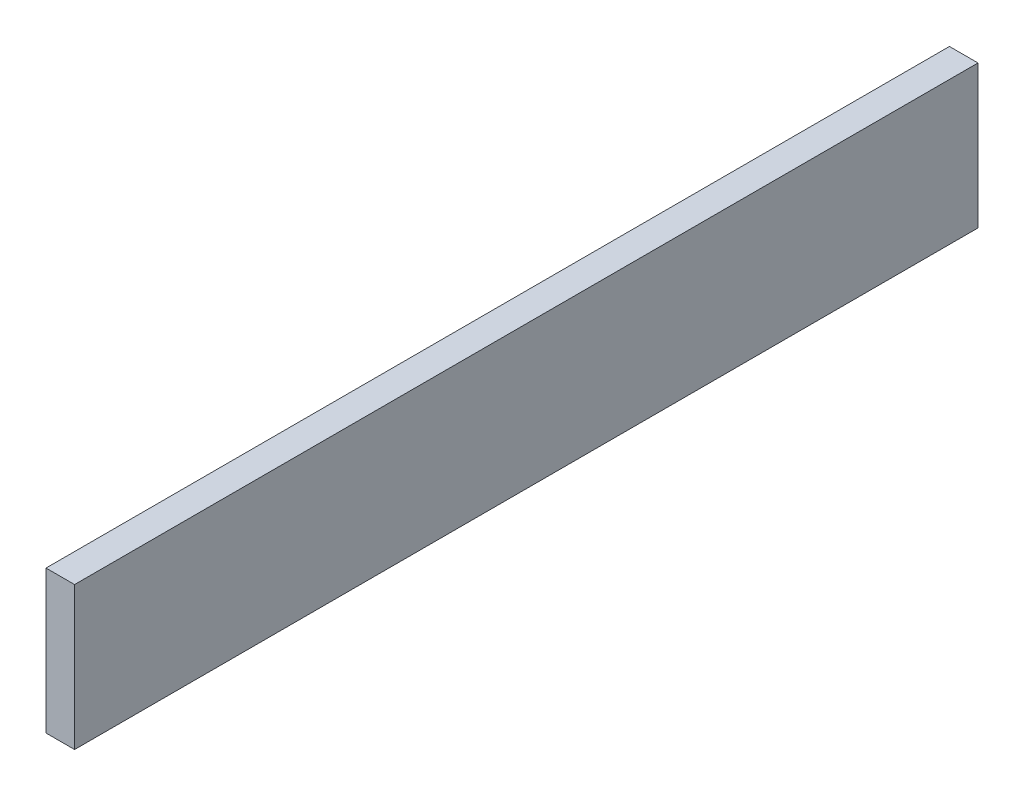
ISO-10303-21;
HEADER;
FILE_DESCRIPTION(('STEP AP214'),'2;1');
FILE_NAME('part.step','',(''),(''),'','','');
FILE_SCHEMA(('AUTOMOTIVE_DESIGN { 1 0 10303 214 1 1 1 1 }'));
ENDSEC;
DATA;
#1=APPLICATION_CONTEXT('core data for automotive mechanical design processes');
#2=APPLICATION_PROTOCOL_DEFINITION('international standard','automotive_design',2000,#1);
#3=PRODUCT_CONTEXT('',#1,'mechanical');
#4=PRODUCT('Part','Part','',(#3));
#5=PRODUCT_RELATED_PRODUCT_CATEGORY('part','',(#4));
#6=PRODUCT_DEFINITION_FORMATION('','',#4);
#7=PRODUCT_DEFINITION_CONTEXT('part definition',#1,'design');
#8=PRODUCT_DEFINITION('design','',#6,#7);
#9=PRODUCT_DEFINITION_SHAPE('','',#8);
#10=(LENGTH_UNIT() NAMED_UNIT(*) SI_UNIT(.MILLI.,.METRE.));
#11=(NAMED_UNIT(*) PLANE_ANGLE_UNIT() SI_UNIT($,.RADIAN.));
#12=(NAMED_UNIT(*) SI_UNIT($,.STERADIAN.) SOLID_ANGLE_UNIT());
#13=UNCERTAINTY_MEASURE_WITH_UNIT(LENGTH_MEASURE(1.E-05),#10,'distance_accuracy_value','');
#14=(GEOMETRIC_REPRESENTATION_CONTEXT(3) GLOBAL_UNCERTAINTY_ASSIGNED_CONTEXT((#13)) GLOBAL_UNIT_ASSIGNED_CONTEXT((#10,
#11,#12)) REPRESENTATION_CONTEXT('',''));
#15=CARTESIAN_POINT('',(0.,0.,0.));
#16=DIRECTION('',(0.,0.,1.));
#17=DIRECTION('',(1.,0.,0.));
#18=AXIS2_PLACEMENT_3D('',#15,#16,#17);
#19=CARTESIAN_POINT('',(1.,0.,0.));
#20=DIRECTION('',(0.,0.,-1.));
#21=DIRECTION('',(-1.,0.,0.));
#22=AXIS2_PLACEMENT_3D('',#19,#20,#21);
#23=PLANE('',#22);
#24=DIRECTION('',(0.,-1.,0.));
#25=VECTOR('',#24,1.);
#26=CARTESIAN_POINT('',(0.,0.,0.));
#27=LINE('',#26,#25);
#28=CARTESIAN_POINT('',(0.,5.,0.));
#29=VERTEX_POINT('',#28);
#30=CARTESIAN_POINT('',(0.,0.,0.));
#31=VERTEX_POINT('',#30);
#32=EDGE_CURVE('E98',#29,#31,#27,.T.);
#33=ORIENTED_EDGE('',*,*,#32,.T.);
#34=DIRECTION('',(-1.,0.,0.));
#35=VECTOR('',#34,1.);
#36=CARTESIAN_POINT('',(1.,0.,0.));
#37=LINE('',#36,#35);
#38=CARTESIAN_POINT('',(1.,0.,0.));
#39=VERTEX_POINT('',#38);
#40=EDGE_CURVE('E11',#39,#31,#37,.T.);
#41=ORIENTED_EDGE('',*,*,#40,.F.);
#42=DIRECTION('',(0.,-1.,0.));
#43=VECTOR('',#42,1.);
#44=CARTESIAN_POINT('',(1.,0.,0.));
#45=LINE('',#44,#43);
#46=CARTESIAN_POINT('',(1.,5.,0.));
#47=VERTEX_POINT('',#46);
#48=EDGE_CURVE('E86',#47,#39,#45,.T.);
#49=ORIENTED_EDGE('',*,*,#48,.F.);
#50=DIRECTION('',(-1.,0.,0.));
#51=VECTOR('',#50,1.);
#52=CARTESIAN_POINT('',(1.,5.,0.));
#53=LINE('',#52,#51);
#54=EDGE_CURVE('E94',#47,#29,#53,.T.);
#55=ORIENTED_EDGE('',*,*,#54,.T.);
#56=EDGE_LOOP('',(#33,#41,#49,#55));
#57=FACE_BOUND('',#56,.T.);
#58=ADVANCED_FACE('F35',(#57),#23,.F.);
#59=CARTESIAN_POINT('',(1.,0.,0.));
#60=DIRECTION('',(0.,1.,0.));
#61=DIRECTION('',(0.,0.,1.));
#62=AXIS2_PLACEMENT_3D('',#59,#60,#61);
#63=PLANE('',#62);
#64=DIRECTION('',(0.,0.,-1.));
#65=VECTOR('',#64,1.);
#66=CARTESIAN_POINT('',(0.,0.,0.));
#67=LINE('',#66,#65);
#68=CARTESIAN_POINT('',(0.,0.,-31.61));
#69=VERTEX_POINT('',#68);
#70=EDGE_CURVE('E90',#31,#69,#67,.T.);
#71=ORIENTED_EDGE('',*,*,#70,.T.);
#72=DIRECTION('',(-1.,0.,0.));
#73=VECTOR('',#72,1.);
#74=CARTESIAN_POINT('',(1.,0.,-31.61));
#75=LINE('',#74,#73);
#76=CARTESIAN_POINT('',(1.,0.,-31.61));
#77=VERTEX_POINT('',#76);
#78=EDGE_CURVE('E43',#77,#69,#75,.T.);
#79=ORIENTED_EDGE('',*,*,#78,.F.);
#80=DIRECTION('',(0.,0.,-1.));
#81=VECTOR('',#80,1.);
#82=CARTESIAN_POINT('',(1.,0.,0.));
#83=LINE('',#82,#81);
#84=EDGE_CURVE('E81',#39,#77,#83,.T.);
#85=ORIENTED_EDGE('',*,*,#84,.F.);
#86=ORIENTED_EDGE('',*,*,#40,.T.);
#87=EDGE_LOOP('',(#71,#79,#85,#86));
#88=FACE_BOUND('',#87,.T.);
#89=ADVANCED_FACE('F89',(#88),#63,.F.);
#90=CARTESIAN_POINT('',(1.,0.,-31.61));
#91=DIRECTION('',(0.,0.,1.));
#92=DIRECTION('',(1.,0.,0.));
#93=AXIS2_PLACEMENT_3D('',#90,#91,#92);
#94=PLANE('',#93);
#95=DIRECTION('',(0.,1.,0.));
#96=VECTOR('',#95,1.);
#97=CARTESIAN_POINT('',(0.,0.,-31.61));
#98=LINE('',#97,#96);
#99=CARTESIAN_POINT('',(0.,5.,-31.61));
#100=VERTEX_POINT('',#99);
#101=EDGE_CURVE('E68',#69,#100,#98,.T.);
#102=ORIENTED_EDGE('',*,*,#101,.T.);
#103=DIRECTION('',(-1.,0.,0.));
#104=VECTOR('',#103,1.);
#105=CARTESIAN_POINT('',(1.,5.,-31.61));
#106=LINE('',#105,#104);
#107=CARTESIAN_POINT('',(1.,5.,-31.61));
#108=VERTEX_POINT('',#107);
#109=EDGE_CURVE('E91',#108,#100,#106,.T.);
#110=ORIENTED_EDGE('',*,*,#109,.F.);
#111=DIRECTION('',(0.,1.,0.));
#112=VECTOR('',#111,1.);
#113=CARTESIAN_POINT('',(1.,0.,-31.61));
#114=LINE('',#113,#112);
#115=EDGE_CURVE('E84',#77,#108,#114,.T.);
#116=ORIENTED_EDGE('',*,*,#115,.F.);
#117=ORIENTED_EDGE('',*,*,#78,.T.);
#118=EDGE_LOOP('',(#102,#110,#116,#117));
#119=FACE_BOUND('',#118,.T.);
#120=ADVANCED_FACE('F92',(#119),#94,.F.);
#121=CARTESIAN_POINT('',(1.,5.,0.));
#122=DIRECTION('',(0.,-1.,0.));
#123=DIRECTION('',(0.,0.,-1.));
#124=AXIS2_PLACEMENT_3D('',#121,#122,#123);
#125=PLANE('',#124);
#126=DIRECTION('',(0.,0.,1.));
#127=VECTOR('',#126,1.);
#128=CARTESIAN_POINT('',(0.,5.,0.));
#129=LINE('',#128,#127);
#130=EDGE_CURVE('E74',#100,#29,#129,.T.);
#131=ORIENTED_EDGE('',*,*,#130,.T.);
#132=ORIENTED_EDGE('',*,*,#54,.F.);
#133=DIRECTION('',(0.,0.,1.));
#134=VECTOR('',#133,1.);
#135=CARTESIAN_POINT('',(1.,5.,0.));
#136=LINE('',#135,#134);
#137=EDGE_CURVE('E51',#108,#47,#136,.T.);
#138=ORIENTED_EDGE('',*,*,#137,.F.);
#139=ORIENTED_EDGE('',*,*,#109,.T.);
#140=EDGE_LOOP('',(#131,#132,#138,#139));
#141=FACE_BOUND('',#140,.T.);
#142=ADVANCED_FACE('F105',(#141),#125,.F.);
#143=CARTESIAN_POINT('',(1.,0.,0.));
#144=DIRECTION('',(-1.,0.,0.));
#145=DIRECTION('',(0.,0.,1.));
#146=AXIS2_PLACEMENT_3D('',#143,#144,#145);
#147=PLANE('',#146);
#148=ORIENTED_EDGE('',*,*,#48,.T.);
#149=ORIENTED_EDGE('',*,*,#84,.T.);
#150=ORIENTED_EDGE('',*,*,#115,.T.);
#151=ORIENTED_EDGE('',*,*,#137,.T.);
#152=EDGE_LOOP('',(#148,#149,#150,#151));
#153=FACE_BOUND('',#152,.T.);
#154=ADVANCED_FACE('F82',(#153),#147,.F.);
#155=CARTESIAN_POINT('',(0.,0.,0.));
#156=DIRECTION('',(-1.,0.,0.));
#157=DIRECTION('',(0.,0.,1.));
#158=AXIS2_PLACEMENT_3D('',#155,#156,#157);
#159=PLANE('',#158);
#160=ORIENTED_EDGE('',*,*,#32,.F.);
#161=ORIENTED_EDGE('',*,*,#130,.F.);
#162=ORIENTED_EDGE('',*,*,#101,.F.);
#163=ORIENTED_EDGE('',*,*,#70,.F.);
#164=EDGE_LOOP('',(#160,#161,#162,#163));
#165=FACE_BOUND('',#164,.T.);
#166=ADVANCED_FACE('F108',(#165),#159,.T.);
#167=CLOSED_SHELL('',(#58,#89,#120,#142,#154,#166));
#168=MANIFOLD_SOLID_BREP('B2',#167);
#169=ADVANCED_BREP_SHAPE_REPRESENTATION('',(#18,#168),#14);
#170=SHAPE_DEFINITION_REPRESENTATION(#9,#169);
ENDSEC;
END-ISO-10303-21;
